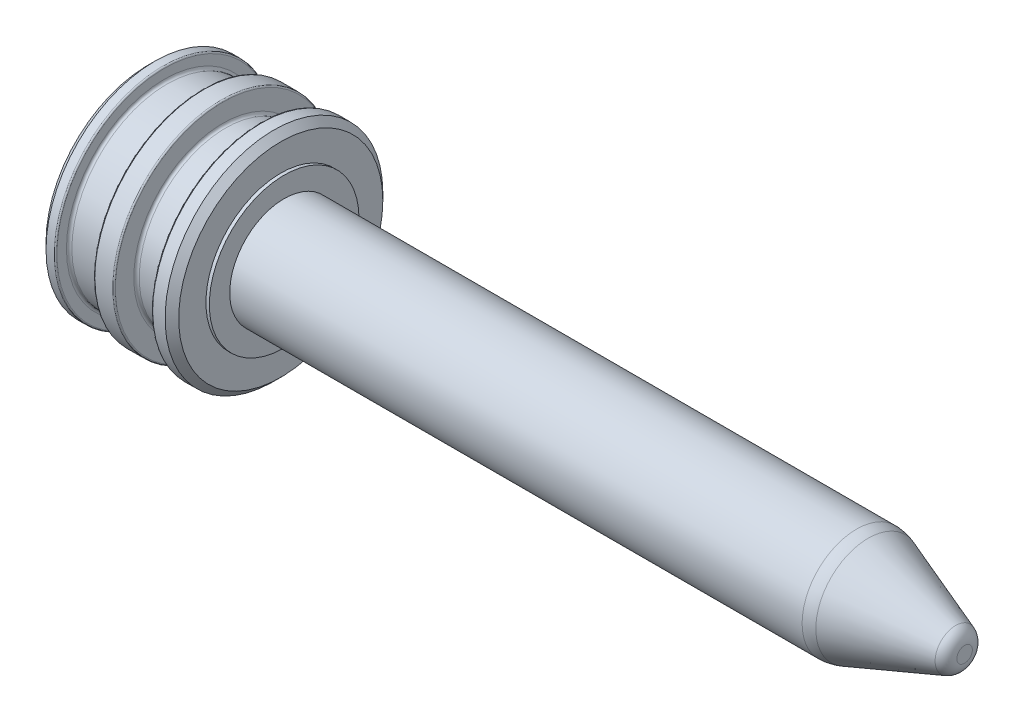
ISO-10303-21;
HEADER;
FILE_DESCRIPTION(('STEP AP214'),'2;1');
FILE_NAME('part.step','',(''),(''),'','','');
FILE_SCHEMA(('AUTOMOTIVE_DESIGN { 1 0 10303 214 1 1 1 1 }'));
ENDSEC;
DATA;
#1=APPLICATION_CONTEXT('core data for automotive mechanical design processes');
#2=APPLICATION_PROTOCOL_DEFINITION('international standard','automotive_design',2000,#1);
#3=PRODUCT_CONTEXT('',#1,'mechanical');
#4=PRODUCT('Part','Part','',(#3));
#5=PRODUCT_RELATED_PRODUCT_CATEGORY('part','',(#4));
#6=PRODUCT_DEFINITION_FORMATION('','',#4);
#7=PRODUCT_DEFINITION_CONTEXT('part definition',#1,'design');
#8=PRODUCT_DEFINITION('design','',#6,#7);
#9=PRODUCT_DEFINITION_SHAPE('','',#8);
#10=(LENGTH_UNIT() NAMED_UNIT(*) SI_UNIT(.MILLI.,.METRE.));
#11=(NAMED_UNIT(*) PLANE_ANGLE_UNIT() SI_UNIT($,.RADIAN.));
#12=(NAMED_UNIT(*) SI_UNIT($,.STERADIAN.) SOLID_ANGLE_UNIT());
#13=UNCERTAINTY_MEASURE_WITH_UNIT(LENGTH_MEASURE(1.E-05),#10,'distance_accuracy_value','');
#14=(GEOMETRIC_REPRESENTATION_CONTEXT(3) GLOBAL_UNCERTAINTY_ASSIGNED_CONTEXT((#13)) GLOBAL_UNIT_ASSIGNED_CONTEXT((#10,
#11,#12)) REPRESENTATION_CONTEXT('',''));
#15=CARTESIAN_POINT('',(0.,0.,0.));
#16=DIRECTION('',(0.,0.,1.));
#17=DIRECTION('',(1.,0.,0.));
#18=AXIS2_PLACEMENT_3D('',#15,#16,#17);
#19=CARTESIAN_POINT('',(0.,0.,0.));
#20=DIRECTION('',(1.,0.,0.));
#21=DIRECTION('',(0.,0.,-1.));
#22=AXIS2_PLACEMENT_3D('',#19,#20,#21);
#23=CYLINDRICAL_SURFACE('',#22,8.);
#24=CARTESIAN_POINT('',(84.1183650964577,0.,0.));
#25=DIRECTION('',(-1.,0.,0.));
#26=DIRECTION('',(0.,0.,1.));
#27=AXIS2_PLACEMENT_3D('',#24,#25,#26);
#28=CIRCLE('',#27,8.);
#29=CARTESIAN_POINT('',(84.1183650964577,0.,8.));
#30=VERTEX_POINT('',#29);
#31=EDGE_CURVE('E118',#30,#30,#28,.T.);
#32=ORIENTED_EDGE('',*,*,#31,.T.);
#33=EDGE_LOOP('',(#32));
#34=FACE_BOUND('',#33,.T.);
#35=CARTESIAN_POINT('',(0.,0.,0.));
#36=DIRECTION('',(1.,0.,0.));
#37=DIRECTION('',(0.,0.,-1.));
#38=AXIS2_PLACEMENT_3D('',#35,#36,#37);
#39=CIRCLE('',#38,8.);
#40=CARTESIAN_POINT('',(0.,0.,-8.));
#41=VERTEX_POINT('',#40);
#42=EDGE_CURVE('E635',#41,#41,#39,.T.);
#43=ORIENTED_EDGE('',*,*,#42,.T.);
#44=EDGE_LOOP('',(#43));
#45=FACE_BOUND('',#44,.T.);
#46=ADVANCED_FACE('F39',(#34,#45),#23,.T.);
#47=CARTESIAN_POINT('',(100.,0.,0.));
#48=DIRECTION('',(-1.,0.,0.));
#49=DIRECTION('',(0.,0.,1.));
#50=AXIS2_PLACEMENT_3D('',#47,#48,#49);
#51=CONICAL_SURFACE('',#50,2.54044648600695,0.349065850398867);
#52=CARTESIAN_POINT('',(98.6840402866513,0.,0.));
#53=DIRECTION('',(1.,0.,0.));
#54=DIRECTION('',(0.,0.,-1.));
#55=AXIS2_PLACEMENT_3D('',#52,#53,#54);
#56=CIRCLE('',#55,3.01941665115935);
#57=CARTESIAN_POINT('',(98.6840402866513,0.,-3.01941665115935));
#58=VERTEX_POINT('',#57);
#59=EDGE_CURVE('E124',#58,#58,#56,.F.);
#60=ORIENTED_EDGE('',*,*,#59,.T.);
#61=EDGE_LOOP('',(#60));
#62=FACE_BOUND('',#61,.T.);
#63=CARTESIAN_POINT('',(85.828465813086,0.,0.));
#64=DIRECTION('',(1.,0.,0.));
#65=DIRECTION('',(0.,0.,-1.));
#66=AXIS2_PLACEMENT_3D('',#63,#64,#65);
#67=CIRCLE('',#66,7.69846310392954);
#68=CARTESIAN_POINT('',(85.828465813086,0.,-7.69846310392954));
#69=VERTEX_POINT('',#68);
#70=EDGE_CURVE('E115',#69,#69,#67,.T.);
#71=ORIENTED_EDGE('',*,*,#70,.T.);
#72=EDGE_LOOP('',(#71));
#73=FACE_BOUND('',#72,.T.);
#74=ADVANCED_FACE('F196',(#62,#73),#51,.T.);
#75=CARTESIAN_POINT('',(100.,2.54044648600695,0.));
#76=DIRECTION('',(1.,0.,0.));
#77=DIRECTION('',(0.,0.,-1.));
#78=AXIS2_PLACEMENT_3D('',#75,#76,#77);
#79=PLANE('',#78);
#80=CARTESIAN_POINT('',(100.,0.,0.));
#81=DIRECTION('',(1.,0.,0.));
#82=DIRECTION('',(0.,0.,-1.));
#83=AXIS2_PLACEMENT_3D('',#80,#81,#82);
#84=CIRCLE('',#83,1.14003140958753);
#85=CARTESIAN_POINT('',(100.,0.,-1.14003140958753));
#86=VERTEX_POINT('',#85);
#87=EDGE_CURVE('E121',#86,#86,#84,.T.);
#88=ORIENTED_EDGE('',*,*,#87,.T.);
#89=EDGE_LOOP('',(#88));
#90=FACE_BOUND('',#89,.T.);
#91=ADVANCED_FACE('F202',(#90),#79,.T.);
#92=CARTESIAN_POINT('',(82.,0.,0.));
#93=DIRECTION('',(-1.,0.,0.));
#94=DIRECTION('',(0.,0.,1.));
#95=AXIS2_PLACEMENT_3D('',#92,#93,#94);
#96=CONICAL_SURFACE('',#95,5.,1.02974425867666);
#97=CARTESIAN_POINT('',(85.0043030951378,0.,0.));
#98=VERTEX_POINT('',#97);
#99=VERTEX_LOOP('',#98);
#100=FACE_BOUND('',#99,.T.);
#101=CARTESIAN_POINT('',(82.,0.,0.));
#102=DIRECTION('',(1.,0.,0.));
#103=DIRECTION('',(0.,0.,-1.));
#104=AXIS2_PLACEMENT_3D('',#101,#102,#103);
#105=CIRCLE('',#104,5.);
#106=CARTESIAN_POINT('',(82.,0.,-5.));
#107=VERTEX_POINT('',#106);
#108=EDGE_CURVE('E105',#107,#107,#105,.T.);
#109=ORIENTED_EDGE('',*,*,#108,.F.);
#110=EDGE_LOOP('',(#109));
#111=FACE_BOUND('',#110,.T.);
#112=ADVANCED_FACE('F297',(#100,#111),#96,.F.);
#113=CARTESIAN_POINT('',(0.,0.,0.));
#114=DIRECTION('',(1.,0.,0.));
#115=DIRECTION('',(0.,0.,-1.));
#116=AXIS2_PLACEMENT_3D('',#113,#114,#115);
#117=CYLINDRICAL_SURFACE('',#116,5.);
#118=ORIENTED_EDGE('',*,*,#108,.T.);
#119=EDGE_LOOP('',(#118));
#120=FACE_BOUND('',#119,.T.);
#121=CARTESIAN_POINT('',(-23.,0.,0.));
#122=DIRECTION('',(1.,0.,0.));
#123=DIRECTION('',(0.,0.,-1.));
#124=AXIS2_PLACEMENT_3D('',#121,#122,#123);
#125=CIRCLE('',#124,5.);
#126=CARTESIAN_POINT('',(-23.,0.,-5.));
#127=VERTEX_POINT('',#126);
#128=EDGE_CURVE('E101',#127,#127,#125,.T.);
#129=ORIENTED_EDGE('',*,*,#128,.F.);
#130=EDGE_LOOP('',(#129));
#131=FACE_BOUND('',#130,.T.);
#132=ADVANCED_FACE('F294',(#120,#131),#117,.F.);
#133=CARTESIAN_POINT('',(-23.,7.,0.));
#134=DIRECTION('',(-1.,0.,0.));
#135=DIRECTION('',(0.,0.,1.));
#136=AXIS2_PLACEMENT_3D('',#133,#134,#135);
#137=PLANE('',#136);
#138=CARTESIAN_POINT('',(-23.,9.5,0.));
#139=DIRECTION('',(-1.,0.,0.));
#140=DIRECTION('',(0.,0.,1.));
#141=AXIS2_PLACEMENT_3D('',#138,#139,#140);
#142=CIRCLE('',#141,3.);
#143=CARTESIAN_POINT('',(-23.,6.85526315789473,-1.41610982484095));
#144=VERTEX_POINT('',#143);
#145=CARTESIAN_POINT('',(-23.,6.85526315789473,1.41610982484095));
#146=VERTEX_POINT('',#145);
#147=EDGE_CURVE('E82',#144,#146,#142,.T.);
#148=ORIENTED_EDGE('',*,*,#147,.F.);
#149=CARTESIAN_POINT('',(-23.,0.,0.));
#150=DIRECTION('',(1.,0.,0.));
#151=DIRECTION('',(0.,0.,-1.));
#152=AXIS2_PLACEMENT_3D('',#149,#150,#151);
#153=CIRCLE('',#152,7.);
#154=EDGE_CURVE('E97',#146,#144,#153,.T.);
#155=ORIENTED_EDGE('',*,*,#154,.F.);
#156=EDGE_LOOP('',(#148,#155));
#157=FACE_BOUND('',#156,.T.);
#158=ORIENTED_EDGE('',*,*,#128,.T.);
#159=EDGE_LOOP('',(#158));
#160=FACE_BOUND('',#159,.T.);
#161=ADVANCED_FACE('F95',(#157,#160),#137,.T.);
#162=CARTESIAN_POINT('',(0.,0.,0.));
#163=DIRECTION('',(1.,0.,0.));
#164=DIRECTION('',(0.,0.,-1.));
#165=AXIS2_PLACEMENT_3D('',#162,#163,#164);
#166=CYLINDRICAL_SURFACE('',#165,7.);
#167=DIRECTION('',(-1.,0.,0.));
#168=VECTOR('',#167,1.);
#169=CARTESIAN_POINT('',(-16.5,6.85526315789473,1.41610982484095));
#170=LINE('',#169,#168);
#171=CARTESIAN_POINT('',(-21.2,6.85526315789473,1.41610982484095));
#172=VERTEX_POINT('',#171);
#173=EDGE_CURVE('E90',#146,#172,#170,.F.);
#174=ORIENTED_EDGE('',*,*,#173,.F.);
#175=ORIENTED_EDGE('',*,*,#154,.T.);
#176=DIRECTION('',(-1.,0.,0.));
#177=VECTOR('',#176,1.);
#178=CARTESIAN_POINT('',(-16.5,6.85526315789473,-1.41610982484095));
#179=LINE('',#178,#177);
#180=CARTESIAN_POINT('',(-21.2,6.85526315789473,-1.41610982484095));
#181=VERTEX_POINT('',#180);
#182=EDGE_CURVE('E78',#181,#144,#179,.T.);
#183=ORIENTED_EDGE('',*,*,#182,.F.);
#184=CARTESIAN_POINT('',(-21.2,0.,0.));
#185=DIRECTION('',(1.,0.,0.));
#186=DIRECTION('',(0.,0.,-1.));
#187=AXIS2_PLACEMENT_3D('',#184,#185,#186);
#188=CIRCLE('',#187,7.);
#189=EDGE_CURVE('E102',#172,#181,#188,.T.);
#190=ORIENTED_EDGE('',*,*,#189,.F.);
#191=EDGE_LOOP('',(#174,#175,#183,#190));
#192=FACE_BOUND('',#191,.T.);
#193=ADVANCED_FACE('F100',(#192),#166,.T.);
#194=CARTESIAN_POINT('',(-21.2,7.,0.));
#195=DIRECTION('',(1.,0.,0.));
#196=DIRECTION('',(0.,0.,-1.));
#197=AXIS2_PLACEMENT_3D('',#194,#195,#196);
#198=PLANE('',#197);
#199=CARTESIAN_POINT('',(-21.2,9.5,0.));
#200=DIRECTION('',(1.,0.,0.));
#201=DIRECTION('',(0.,0.,-1.));
#202=AXIS2_PLACEMENT_3D('',#199,#200,#201);
#203=CIRCLE('',#202,3.);
#204=CARTESIAN_POINT('',(-21.2,6.56894736842105,0.639476716475363));
#205=VERTEX_POINT('',#204);
#206=EDGE_CURVE('E91',#172,#205,#203,.T.);
#207=ORIENTED_EDGE('',*,*,#206,.F.);
#208=ORIENTED_EDGE('',*,*,#189,.T.);
#209=CARTESIAN_POINT('',(-21.2,6.56894736842105,-0.639476716475362));
#210=VERTEX_POINT('',#209);
#211=EDGE_CURVE('E85',#210,#181,#203,.T.);
#212=ORIENTED_EDGE('',*,*,#211,.F.);
#213=CARTESIAN_POINT('',(-21.2,0.,0.));
#214=DIRECTION('',(1.,0.,0.));
#215=DIRECTION('',(0.,0.,-1.));
#216=AXIS2_PLACEMENT_3D('',#213,#214,#215);
#217=CIRCLE('',#216,6.6);
#218=EDGE_CURVE('E107',#205,#210,#217,.T.);
#219=ORIENTED_EDGE('',*,*,#218,.F.);
#220=EDGE_LOOP('',(#207,#208,#212,#219));
#221=FACE_BOUND('',#220,.T.);
#222=ADVANCED_FACE('F285',(#221),#198,.T.);
#223=CARTESIAN_POINT('',(0.,0.,0.));
#224=DIRECTION('',(1.,0.,0.));
#225=DIRECTION('',(0.,0.,-1.));
#226=AXIS2_PLACEMENT_3D('',#223,#224,#225);
#227=CYLINDRICAL_SURFACE('',#226,6.6);
#228=DIRECTION('',(-1.,0.,0.));
#229=VECTOR('',#228,1.);
#230=CARTESIAN_POINT('',(-16.5,6.56894736842105,0.639476716475363));
#231=LINE('',#230,#229);
#232=CARTESIAN_POINT('',(-20.,6.56894736842105,0.639476716475362));
#233=VERTEX_POINT('',#232);
#234=EDGE_CURVE('E54',#205,#233,#231,.F.);
#235=ORIENTED_EDGE('',*,*,#234,.F.);
#236=ORIENTED_EDGE('',*,*,#218,.T.);
#237=DIRECTION('',(-1.,0.,0.));
#238=VECTOR('',#237,1.);
#239=CARTESIAN_POINT('',(-16.5,6.56894736842105,-0.639476716475363));
#240=LINE('',#239,#238);
#241=CARTESIAN_POINT('',(-20.,6.56894736842105,-0.639476716475362));
#242=VERTEX_POINT('',#241);
#243=EDGE_CURVE('E642',#242,#210,#240,.T.);
#244=ORIENTED_EDGE('',*,*,#243,.F.);
#245=CARTESIAN_POINT('',(-20.,0.,0.));
#246=DIRECTION('',(1.,0.,0.));
#247=DIRECTION('',(0.,0.,-1.));
#248=AXIS2_PLACEMENT_3D('',#245,#246,#247);
#249=CIRCLE('',#248,6.6);
#250=EDGE_CURVE('E629',#233,#242,#249,.T.);
#251=ORIENTED_EDGE('',*,*,#250,.F.);
#252=EDGE_LOOP('',(#235,#236,#244,#251));
#253=FACE_BOUND('',#252,.T.);
#254=ADVANCED_FACE('F281',(#253),#227,.T.);
#255=CARTESIAN_POINT('',(-20.,16.,0.));
#256=DIRECTION('',(-1.,0.,0.));
#257=DIRECTION('',(0.,0.,1.));
#258=AXIS2_PLACEMENT_3D('',#255,#256,#257);
#259=PLANE('',#258);
#260=CARTESIAN_POINT('',(-20.,0.,0.));
#261=DIRECTION('',(-1.,0.,0.));
#262=DIRECTION('',(0.,0.,1.));
#263=AXIS2_PLACEMENT_3D('',#260,#261,#262);
#264=CIRCLE('',#263,15.);
#265=CARTESIAN_POINT('',(-20.,0.,15.));
#266=VERTEX_POINT('',#265);
#267=EDGE_CURVE('E136',#266,#266,#264,.T.);
#268=ORIENTED_EDGE('',*,*,#267,.T.);
#269=EDGE_LOOP('',(#268));
#270=FACE_BOUND('',#269,.T.);
#271=CARTESIAN_POINT('',(-20.,9.5,0.));
#272=DIRECTION('',(-1.,0.,0.));
#273=DIRECTION('',(0.,0.,1.));
#274=AXIS2_PLACEMENT_3D('',#271,#272,#273);
#275=CIRCLE('',#274,3.);
#276=EDGE_CURVE('E113',#233,#242,#275,.T.);
#277=ORIENTED_EDGE('',*,*,#276,.F.);
#278=ORIENTED_EDGE('',*,*,#250,.T.);
#279=EDGE_LOOP('',(#277,#278));
#280=FACE_BOUND('',#279,.T.);
#281=ADVANCED_FACE('F277',(#270,#280),#259,.T.);
#282=CARTESIAN_POINT('',(0.,0.,0.));
#283=DIRECTION('',(1.,0.,0.));
#284=DIRECTION('',(0.,0.,-1.));
#285=AXIS2_PLACEMENT_3D('',#282,#283,#284);
#286=CYLINDRICAL_SURFACE('',#285,16.);
#287=CARTESIAN_POINT('',(-17.8,0.,0.));
#288=DIRECTION('',(1.,0.,0.));
#289=DIRECTION('',(0.,0.,-1.));
#290=AXIS2_PLACEMENT_3D('',#287,#288,#289);
#291=CIRCLE('',#290,16.);
#292=CARTESIAN_POINT('',(-17.8,0.,-16.));
#293=VERTEX_POINT('',#292);
#294=EDGE_CURVE('E175',#293,#293,#291,.F.);
#295=ORIENTED_EDGE('',*,*,#294,.T.);
#296=EDGE_LOOP('',(#295));
#297=FACE_BOUND('',#296,.T.);
#298=CARTESIAN_POINT('',(-19.,0.,0.));
#299=DIRECTION('',(-1.,0.,0.));
#300=DIRECTION('',(0.,0.,1.));
#301=AXIS2_PLACEMENT_3D('',#298,#299,#300);
#302=CIRCLE('',#301,16.);
#303=CARTESIAN_POINT('',(-19.,0.,16.));
#304=VERTEX_POINT('',#303);
#305=EDGE_CURVE('E133',#304,#304,#302,.F.);
#306=ORIENTED_EDGE('',*,*,#305,.T.);
#307=EDGE_LOOP('',(#306));
#308=FACE_BOUND('',#307,.T.);
#309=ADVANCED_FACE('F257',(#297,#308),#286,.T.);
#310=CARTESIAN_POINT('',(-17.6,14.,0.));
#311=DIRECTION('',(1.,0.,0.));
#312=DIRECTION('',(0.,0.,-1.));
#313=AXIS2_PLACEMENT_3D('',#310,#311,#312);
#314=PLANE('',#313);
#315=CARTESIAN_POINT('',(-17.6,0.,0.));
#316=DIRECTION('',(1.,0.,0.));
#317=DIRECTION('',(0.,0.,-1.));
#318=AXIS2_PLACEMENT_3D('',#315,#316,#317);
#319=CIRCLE('',#318,15.8);
#320=CARTESIAN_POINT('',(-17.6,0.,-15.8));
#321=VERTEX_POINT('',#320);
#322=EDGE_CURVE('E172',#321,#321,#319,.T.);
#323=ORIENTED_EDGE('',*,*,#322,.T.);
#324=EDGE_LOOP('',(#323));
#325=FACE_BOUND('',#324,.T.);
#326=CARTESIAN_POINT('',(-17.6,0.,0.));
#327=DIRECTION('',(1.,0.,0.));
#328=DIRECTION('',(0.,0.,-1.));
#329=AXIS2_PLACEMENT_3D('',#326,#327,#328);
#330=CIRCLE('',#329,14.4);
#331=CARTESIAN_POINT('',(-17.6,0.,-14.4));
#332=VERTEX_POINT('',#331);
#333=EDGE_CURVE('E148',#332,#332,#330,.F.);
#334=ORIENTED_EDGE('',*,*,#333,.T.);
#335=EDGE_LOOP('',(#334));
#336=FACE_BOUND('',#335,.T.);
#337=ADVANCED_FACE('F253',(#325,#336),#314,.T.);
#338=CARTESIAN_POINT('',(0.,0.,0.));
#339=DIRECTION('',(1.,0.,0.));
#340=DIRECTION('',(0.,0.,-1.));
#341=AXIS2_PLACEMENT_3D('',#338,#339,#340);
#342=CYLINDRICAL_SURFACE('',#341,14.);
#343=CARTESIAN_POINT('',(-12.4,0.,0.));
#344=DIRECTION('',(-1.,0.,0.));
#345=DIRECTION('',(0.,0.,1.));
#346=AXIS2_PLACEMENT_3D('',#343,#344,#345);
#347=CIRCLE('',#346,14.);
#348=CARTESIAN_POINT('',(-12.4,0.,14.));
#349=VERTEX_POINT('',#348);
#350=EDGE_CURVE('E145',#349,#349,#347,.T.);
#351=ORIENTED_EDGE('',*,*,#350,.T.);
#352=EDGE_LOOP('',(#351));
#353=FACE_BOUND('',#352,.T.);
#354=CARTESIAN_POINT('',(-17.2,0.,0.));
#355=DIRECTION('',(1.,0.,0.));
#356=DIRECTION('',(0.,0.,-1.));
#357=AXIS2_PLACEMENT_3D('',#354,#355,#356);
#358=CIRCLE('',#357,14.);
#359=CARTESIAN_POINT('',(-17.2,0.,-14.));
#360=VERTEX_POINT('',#359);
#361=EDGE_CURVE('E142',#360,#360,#358,.T.);
#362=ORIENTED_EDGE('',*,*,#361,.T.);
#363=EDGE_LOOP('',(#362));
#364=FACE_BOUND('',#363,.T.);
#365=ADVANCED_FACE('F256',(#353,#364),#342,.T.);
#366=CARTESIAN_POINT('',(-12.,16.,0.));
#367=DIRECTION('',(-1.,0.,0.));
#368=DIRECTION('',(0.,0.,1.));
#369=AXIS2_PLACEMENT_3D('',#366,#367,#368);
#370=PLANE('',#369);
#371=CARTESIAN_POINT('',(-12.,0.,0.));
#372=DIRECTION('',(-1.,0.,0.));
#373=DIRECTION('',(0.,0.,1.));
#374=AXIS2_PLACEMENT_3D('',#371,#372,#373);
#375=CIRCLE('',#374,15.8);
#376=CARTESIAN_POINT('',(-12.,0.,15.8));
#377=VERTEX_POINT('',#376);
#378=EDGE_CURVE('E169',#377,#377,#375,.T.);
#379=ORIENTED_EDGE('',*,*,#378,.T.);
#380=EDGE_LOOP('',(#379));
#381=FACE_BOUND('',#380,.T.);
#382=CARTESIAN_POINT('',(-12.,0.,0.));
#383=DIRECTION('',(-1.,0.,0.));
#384=DIRECTION('',(0.,0.,1.));
#385=AXIS2_PLACEMENT_3D('',#382,#383,#384);
#386=CIRCLE('',#385,14.4);
#387=CARTESIAN_POINT('',(-12.,0.,14.4));
#388=VERTEX_POINT('',#387);
#389=EDGE_CURVE('E139',#388,#388,#386,.F.);
#390=ORIENTED_EDGE('',*,*,#389,.T.);
#391=EDGE_LOOP('',(#390));
#392=FACE_BOUND('',#391,.T.);
#393=ADVANCED_FACE('F264',(#381,#392),#370,.T.);
#394=CARTESIAN_POINT('',(0.,0.,0.));
#395=DIRECTION('',(1.,0.,0.));
#396=DIRECTION('',(0.,0.,-1.));
#397=AXIS2_PLACEMENT_3D('',#394,#395,#396);
#398=CYLINDRICAL_SURFACE('',#397,16.);
#399=CARTESIAN_POINT('',(-11.8,0.,0.));
#400=DIRECTION('',(-1.,0.,0.));
#401=DIRECTION('',(0.,0.,1.));
#402=AXIS2_PLACEMENT_3D('',#399,#400,#401);
#403=CIRCLE('',#402,16.);
#404=CARTESIAN_POINT('',(-11.8,0.,16.));
#405=VERTEX_POINT('',#404);
#406=EDGE_CURVE('E166',#405,#405,#403,.F.);
#407=ORIENTED_EDGE('',*,*,#406,.T.);
#408=EDGE_LOOP('',(#407));
#409=FACE_BOUND('',#408,.T.);
#410=CARTESIAN_POINT('',(-9.2,0.,0.));
#411=DIRECTION('',(1.,0.,0.));
#412=DIRECTION('',(0.,0.,-1.));
#413=AXIS2_PLACEMENT_3D('',#410,#411,#412);
#414=CIRCLE('',#413,16.);
#415=CARTESIAN_POINT('',(-9.2,0.,-16.));
#416=VERTEX_POINT('',#415);
#417=EDGE_CURVE('E163',#416,#416,#414,.F.);
#418=ORIENTED_EDGE('',*,*,#417,.T.);
#419=EDGE_LOOP('',(#418));
#420=FACE_BOUND('',#419,.T.);
#421=ADVANCED_FACE('F270',(#409,#420),#398,.T.);
#422=CARTESIAN_POINT('',(-9.,12.7,0.));
#423=DIRECTION('',(1.,0.,0.));
#424=DIRECTION('',(0.,0.,-1.));
#425=AXIS2_PLACEMENT_3D('',#422,#423,#424);
#426=PLANE('',#425);
#427=CARTESIAN_POINT('',(-9.,0.,0.));
#428=DIRECTION('',(1.,0.,0.));
#429=DIRECTION('',(0.,0.,-1.));
#430=AXIS2_PLACEMENT_3D('',#427,#428,#429);
#431=CIRCLE('',#430,15.8);
#432=CARTESIAN_POINT('',(-9.,0.,-15.8));
#433=VERTEX_POINT('',#432);
#434=EDGE_CURVE('E178',#433,#433,#431,.T.);
#435=ORIENTED_EDGE('',*,*,#434,.T.);
#436=EDGE_LOOP('',(#435));
#437=FACE_BOUND('',#436,.T.);
#438=CARTESIAN_POINT('',(-9.,0.,0.));
#439=DIRECTION('',(1.,0.,0.));
#440=DIRECTION('',(0.,0.,-1.));
#441=AXIS2_PLACEMENT_3D('',#438,#439,#440);
#442=CIRCLE('',#441,13.1);
#443=CARTESIAN_POINT('',(-9.,0.,-13.1));
#444=VERTEX_POINT('',#443);
#445=EDGE_CURVE('E160',#444,#444,#442,.F.);
#446=ORIENTED_EDGE('',*,*,#445,.T.);
#447=EDGE_LOOP('',(#446));
#448=FACE_BOUND('',#447,.T.);
#449=ADVANCED_FACE('F368',(#437,#448),#426,.T.);
#450=CARTESIAN_POINT('',(0.,0.,0.));
#451=DIRECTION('',(1.,0.,0.));
#452=DIRECTION('',(0.,0.,-1.));
#453=AXIS2_PLACEMENT_3D('',#450,#451,#452);
#454=CYLINDRICAL_SURFACE('',#453,12.7);
#455=CARTESIAN_POINT('',(-3.9,0.,0.));
#456=DIRECTION('',(-1.,0.,0.));
#457=DIRECTION('',(0.,0.,1.));
#458=AXIS2_PLACEMENT_3D('',#455,#456,#457);
#459=CIRCLE('',#458,12.7);
#460=CARTESIAN_POINT('',(-3.9,0.,12.7));
#461=VERTEX_POINT('',#460);
#462=EDGE_CURVE('E157',#461,#461,#459,.T.);
#463=ORIENTED_EDGE('',*,*,#462,.T.);
#464=EDGE_LOOP('',(#463));
#465=FACE_BOUND('',#464,.T.);
#466=CARTESIAN_POINT('',(-8.6,0.,0.));
#467=DIRECTION('',(1.,0.,0.));
#468=DIRECTION('',(0.,0.,-1.));
#469=AXIS2_PLACEMENT_3D('',#466,#467,#468);
#470=CIRCLE('',#469,12.7);
#471=CARTESIAN_POINT('',(-8.6,0.,-12.7));
#472=VERTEX_POINT('',#471);
#473=EDGE_CURVE('E154',#472,#472,#470,.T.);
#474=ORIENTED_EDGE('',*,*,#473,.T.);
#475=EDGE_LOOP('',(#474));
#476=FACE_BOUND('',#475,.T.);
#477=ADVANCED_FACE('F378',(#465,#476),#454,.T.);
#478=CARTESIAN_POINT('',(-3.5,16.,0.));
#479=DIRECTION('',(-1.,0.,0.));
#480=DIRECTION('',(0.,0.,1.));
#481=AXIS2_PLACEMENT_3D('',#478,#479,#480);
#482=PLANE('',#481);
#483=CARTESIAN_POINT('',(-3.5,0.,0.));
#484=DIRECTION('',(-1.,0.,0.));
#485=DIRECTION('',(0.,0.,1.));
#486=AXIS2_PLACEMENT_3D('',#483,#484,#485);
#487=CIRCLE('',#486,15.8);
#488=CARTESIAN_POINT('',(-3.5,0.,15.8));
#489=VERTEX_POINT('',#488);
#490=EDGE_CURVE('E11',#489,#489,#487,.T.);
#491=ORIENTED_EDGE('',*,*,#490,.T.);
#492=EDGE_LOOP('',(#491));
#493=FACE_BOUND('',#492,.T.);
#494=CARTESIAN_POINT('',(-3.5,0.,0.));
#495=DIRECTION('',(-1.,0.,0.));
#496=DIRECTION('',(0.,0.,1.));
#497=AXIS2_PLACEMENT_3D('',#494,#495,#496);
#498=CIRCLE('',#497,13.1);
#499=CARTESIAN_POINT('',(-3.5,0.,13.1));
#500=VERTEX_POINT('',#499);
#501=EDGE_CURVE('E151',#500,#500,#498,.F.);
#502=ORIENTED_EDGE('',*,*,#501,.T.);
#503=EDGE_LOOP('',(#502));
#504=FACE_BOUND('',#503,.T.);
#505=ADVANCED_FACE('F387',(#493,#504),#482,.T.);
#506=CARTESIAN_POINT('',(0.,0.,0.));
#507=DIRECTION('',(1.,0.,0.));
#508=DIRECTION('',(0.,0.,-1.));
#509=AXIS2_PLACEMENT_3D('',#506,#507,#508);
#510=CYLINDRICAL_SURFACE('',#509,16.);
#511=CARTESIAN_POINT('',(-3.3,0.,0.));
#512=DIRECTION('',(-1.,0.,0.));
#513=DIRECTION('',(0.,0.,1.));
#514=AXIS2_PLACEMENT_3D('',#511,#512,#513);
#515=CIRCLE('',#514,16.);
#516=CARTESIAN_POINT('',(-3.3,0.,16.));
#517=VERTEX_POINT('',#516);
#518=EDGE_CURVE('E47',#517,#517,#515,.F.);
#519=ORIENTED_EDGE('',*,*,#518,.T.);
#520=EDGE_LOOP('',(#519));
#521=FACE_BOUND('',#520,.T.);
#522=CARTESIAN_POINT('',(-1.5,0.,0.));
#523=DIRECTION('',(1.,0.,0.));
#524=DIRECTION('',(0.,0.,-1.));
#525=AXIS2_PLACEMENT_3D('',#522,#523,#524);
#526=CIRCLE('',#525,16.);
#527=CARTESIAN_POINT('',(-1.5,0.,-16.));
#528=VERTEX_POINT('',#527);
#529=EDGE_CURVE('E130',#528,#528,#526,.F.);
#530=ORIENTED_EDGE('',*,*,#529,.T.);
#531=EDGE_LOOP('',(#530));
#532=FACE_BOUND('',#531,.T.);
#533=ADVANCED_FACE('F183',(#521,#532),#510,.T.);
#534=CARTESIAN_POINT('',(-0.5,11.,0.));
#535=DIRECTION('',(1.,0.,0.));
#536=DIRECTION('',(0.,0.,-1.));
#537=AXIS2_PLACEMENT_3D('',#534,#535,#536);
#538=PLANE('',#537);
#539=CARTESIAN_POINT('',(-0.5,0.,0.));
#540=DIRECTION('',(1.,0.,0.));
#541=DIRECTION('',(0.,0.,-1.));
#542=AXIS2_PLACEMENT_3D('',#539,#540,#541);
#543=CIRCLE('',#542,15.);
#544=CARTESIAN_POINT('',(-0.5,0.,-15.));
#545=VERTEX_POINT('',#544);
#546=EDGE_CURVE('E127',#545,#545,#543,.T.);
#547=ORIENTED_EDGE('',*,*,#546,.T.);
#548=EDGE_LOOP('',(#547));
#549=FACE_BOUND('',#548,.T.);
#550=CARTESIAN_POINT('',(-0.5,0.,0.));
#551=DIRECTION('',(1.,0.,0.));
#552=DIRECTION('',(0.,0.,-1.));
#553=AXIS2_PLACEMENT_3D('',#550,#551,#552);
#554=CIRCLE('',#553,11.);
#555=CARTESIAN_POINT('',(-0.5,0.,-11.));
#556=VERTEX_POINT('',#555);
#557=EDGE_CURVE('E628',#556,#556,#554,.T.);
#558=ORIENTED_EDGE('',*,*,#557,.F.);
#559=EDGE_LOOP('',(#558));
#560=FACE_BOUND('',#559,.T.);
#561=ADVANCED_FACE('F402',(#549,#560),#538,.T.);
#562=CARTESIAN_POINT('',(0.,0.,0.));
#563=DIRECTION('',(1.,0.,0.));
#564=DIRECTION('',(0.,0.,-1.));
#565=AXIS2_PLACEMENT_3D('',#562,#563,#564);
#566=CYLINDRICAL_SURFACE('',#565,11.);
#567=ORIENTED_EDGE('',*,*,#557,.T.);
#568=EDGE_LOOP('',(#567));
#569=FACE_BOUND('',#568,.T.);
#570=CARTESIAN_POINT('',(0.,0.,0.));
#571=DIRECTION('',(1.,0.,0.));
#572=DIRECTION('',(0.,0.,-1.));
#573=AXIS2_PLACEMENT_3D('',#570,#571,#572);
#574=CIRCLE('',#573,11.);
#575=CARTESIAN_POINT('',(0.,0.,-11.));
#576=VERTEX_POINT('',#575);
#577=EDGE_CURVE('E630',#576,#576,#574,.T.);
#578=ORIENTED_EDGE('',*,*,#577,.F.);
#579=EDGE_LOOP('',(#578));
#580=FACE_BOUND('',#579,.T.);
#581=ADVANCED_FACE('F505',(#569,#580),#566,.T.);
#582=CARTESIAN_POINT('',(0.,11.,0.));
#583=DIRECTION('',(1.,0.,0.));
#584=DIRECTION('',(0.,0.,-1.));
#585=AXIS2_PLACEMENT_3D('',#582,#583,#584);
#586=PLANE('',#585);
#587=ORIENTED_EDGE('',*,*,#577,.T.);
#588=EDGE_LOOP('',(#587));
#589=FACE_BOUND('',#588,.T.);
#590=ORIENTED_EDGE('',*,*,#42,.F.);
#591=EDGE_LOOP('',(#590));
#592=FACE_BOUND('',#591,.T.);
#593=ADVANCED_FACE('F497',(#589,#592),#586,.T.);
#594=CARTESIAN_POINT('',(-10.,9.5,0.));
#595=DIRECTION('',(-1.,0.,0.));
#596=DIRECTION('',(0.,0.,1.));
#597=AXIS2_PLACEMENT_3D('',#594,#595,#596);
#598=CYLINDRICAL_SURFACE('',#597,3.);
#599=ORIENTED_EDGE('',*,*,#173,.T.);
#600=ORIENTED_EDGE('',*,*,#206,.T.);
#601=ORIENTED_EDGE('',*,*,#234,.T.);
#602=ORIENTED_EDGE('',*,*,#276,.T.);
#603=ORIENTED_EDGE('',*,*,#243,.T.);
#604=ORIENTED_EDGE('',*,*,#211,.T.);
#605=ORIENTED_EDGE('',*,*,#182,.T.);
#606=ORIENTED_EDGE('',*,*,#147,.T.);
#607=EDGE_LOOP('',(#599,#600,#601,#602,#603,#604,#605,#606));
#608=FACE_BOUND('',#607,.T.);
#609=CARTESIAN_POINT('',(-10.,9.5,0.));
#610=DIRECTION('',(-1.,0.,0.));
#611=DIRECTION('',(0.,0.,1.));
#612=AXIS2_PLACEMENT_3D('',#609,#610,#611);
#613=CIRCLE('',#612,3.);
#614=CARTESIAN_POINT('',(-10.,9.5,3.));
#615=VERTEX_POINT('',#614);
#616=EDGE_CURVE('E98',#615,#615,#613,.T.);
#617=ORIENTED_EDGE('',*,*,#616,.F.);
#618=EDGE_LOOP('',(#617));
#619=FACE_BOUND('',#618,.T.);
#620=ADVANCED_FACE('F80',(#608,#619),#598,.F.);
#621=CARTESIAN_POINT('',(-10.,9.5,0.));
#622=DIRECTION('',(-1.,0.,0.));
#623=DIRECTION('',(0.,0.,1.));
#624=AXIS2_PLACEMENT_3D('',#621,#622,#623);
#625=PLANE('',#624);
#626=ORIENTED_EDGE('',*,*,#616,.T.);
#627=EDGE_LOOP('',(#626));
#628=FACE_BOUND('',#627,.T.);
#629=ADVANCED_FACE('F212',(#628),#625,.T.);
#630=CARTESIAN_POINT('',(84.1183650964577,0.,0.));
#631=DIRECTION('',(-1.,0.,0.));
#632=DIRECTION('',(0.,0.,1.));
#633=AXIS2_PLACEMENT_3D('',#630,#631,#632);
#634=DEGENERATE_TOROIDAL_SURFACE('',#633,3.,5.,.T.);
#635=ORIENTED_EDGE('',*,*,#31,.F.);
#636=EDGE_LOOP('',(#635));
#637=FACE_BOUND('',#636,.T.);
#638=ORIENTED_EDGE('',*,*,#70,.F.);
#639=EDGE_LOOP('',(#638));
#640=FACE_BOUND('',#639,.T.);
#641=ADVANCED_FACE('F208',(#637,#640),#634,.T.);
#642=CARTESIAN_POINT('',(98.,0.,0.));
#643=DIRECTION('',(1.,0.,0.));
#644=DIRECTION('',(0.,0.,-1.));
#645=AXIS2_PLACEMENT_3D('',#642,#643,#644);
#646=DEGENERATE_TOROIDAL_SURFACE('',#645,1.14003140958753,2.,.T.);
#647=ORIENTED_EDGE('',*,*,#59,.F.);
#648=EDGE_LOOP('',(#647));
#649=FACE_BOUND('',#648,.T.);
#650=ORIENTED_EDGE('',*,*,#87,.F.);
#651=EDGE_LOOP('',(#650));
#652=FACE_BOUND('',#651,.T.);
#653=ADVANCED_FACE('F211',(#649,#652),#646,.T.);
#654=CARTESIAN_POINT('',(-0.5,0.,0.));
#655=DIRECTION('',(-1.,0.,0.));
#656=DIRECTION('',(0.,0.,1.));
#657=AXIS2_PLACEMENT_3D('',#654,#655,#656);
#658=CONICAL_SURFACE('',#657,15.,0.785398163397448);
#659=ORIENTED_EDGE('',*,*,#529,.F.);
#660=EDGE_LOOP('',(#659));
#661=FACE_BOUND('',#660,.T.);
#662=ORIENTED_EDGE('',*,*,#546,.F.);
#663=EDGE_LOOP('',(#662));
#664=FACE_BOUND('',#663,.T.);
#665=ADVANCED_FACE('F216',(#661,#664),#658,.T.);
#666=CARTESIAN_POINT('',(-19.,0.,0.));
#667=DIRECTION('',(1.,0.,0.));
#668=DIRECTION('',(0.,0.,-1.));
#669=AXIS2_PLACEMENT_3D('',#666,#667,#668);
#670=CONICAL_SURFACE('',#669,16.,0.785398163397448);
#671=ORIENTED_EDGE('',*,*,#267,.F.);
#672=EDGE_LOOP('',(#671));
#673=FACE_BOUND('',#672,.T.);
#674=ORIENTED_EDGE('',*,*,#305,.F.);
#675=EDGE_LOOP('',(#674));
#676=FACE_BOUND('',#675,.T.);
#677=ADVANCED_FACE('F220',(#673,#676),#670,.T.);
#678=CARTESIAN_POINT('',(-12.4,0.,0.));
#679=DIRECTION('',(-1.,0.,0.));
#680=DIRECTION('',(0.,0.,1.));
#681=AXIS2_PLACEMENT_3D('',#678,#679,#680);
#682=TOROIDAL_SURFACE('',#681,14.4,0.4);
#683=ORIENTED_EDGE('',*,*,#350,.F.);
#684=EDGE_LOOP('',(#683));
#685=FACE_BOUND('',#684,.T.);
#686=ORIENTED_EDGE('',*,*,#389,.F.);
#687=EDGE_LOOP('',(#686));
#688=FACE_BOUND('',#687,.T.);
#689=ADVANCED_FACE('F224',(#685,#688),#682,.F.);
#690=CARTESIAN_POINT('',(-17.2,0.,0.));
#691=DIRECTION('',(1.,0.,0.));
#692=DIRECTION('',(0.,0.,-1.));
#693=AXIS2_PLACEMENT_3D('',#690,#691,#692);
#694=TOROIDAL_SURFACE('',#693,14.4,0.4);
#695=ORIENTED_EDGE('',*,*,#333,.F.);
#696=EDGE_LOOP('',(#695));
#697=FACE_BOUND('',#696,.T.);
#698=ORIENTED_EDGE('',*,*,#361,.F.);
#699=EDGE_LOOP('',(#698));
#700=FACE_BOUND('',#699,.T.);
#701=ADVANCED_FACE('F228',(#697,#700),#694,.F.);
#702=CARTESIAN_POINT('',(-3.9,0.,0.));
#703=DIRECTION('',(-1.,0.,0.));
#704=DIRECTION('',(0.,0.,1.));
#705=AXIS2_PLACEMENT_3D('',#702,#703,#704);
#706=TOROIDAL_SURFACE('',#705,13.1,0.4);
#707=ORIENTED_EDGE('',*,*,#462,.F.);
#708=EDGE_LOOP('',(#707));
#709=FACE_BOUND('',#708,.T.);
#710=ORIENTED_EDGE('',*,*,#501,.F.);
#711=EDGE_LOOP('',(#710));
#712=FACE_BOUND('',#711,.T.);
#713=ADVANCED_FACE('F232',(#709,#712),#706,.F.);
#714=CARTESIAN_POINT('',(-8.6,0.,0.));
#715=DIRECTION('',(1.,0.,0.));
#716=DIRECTION('',(0.,0.,-1.));
#717=AXIS2_PLACEMENT_3D('',#714,#715,#716);
#718=TOROIDAL_SURFACE('',#717,13.1,0.4);
#719=ORIENTED_EDGE('',*,*,#445,.F.);
#720=EDGE_LOOP('',(#719));
#721=FACE_BOUND('',#720,.T.);
#722=ORIENTED_EDGE('',*,*,#473,.F.);
#723=EDGE_LOOP('',(#722));
#724=FACE_BOUND('',#723,.T.);
#725=ADVANCED_FACE('F236',(#721,#724),#718,.F.);
#726=CARTESIAN_POINT('',(-11.8,0.,0.));
#727=DIRECTION('',(-1.,0.,0.));
#728=DIRECTION('',(0.,0.,1.));
#729=AXIS2_PLACEMENT_3D('',#726,#727,#728);
#730=TOROIDAL_SURFACE('',#729,15.8,0.2);
#731=ORIENTED_EDGE('',*,*,#378,.F.);
#732=EDGE_LOOP('',(#731));
#733=FACE_BOUND('',#732,.T.);
#734=ORIENTED_EDGE('',*,*,#406,.F.);
#735=EDGE_LOOP('',(#734));
#736=FACE_BOUND('',#735,.T.);
#737=ADVANCED_FACE('F240',(#733,#736),#730,.T.);
#738=CARTESIAN_POINT('',(-17.8,0.,0.));
#739=DIRECTION('',(1.,0.,0.));
#740=DIRECTION('',(0.,0.,-1.));
#741=AXIS2_PLACEMENT_3D('',#738,#739,#740);
#742=TOROIDAL_SURFACE('',#741,15.8,0.2);
#743=ORIENTED_EDGE('',*,*,#294,.F.);
#744=EDGE_LOOP('',(#743));
#745=FACE_BOUND('',#744,.T.);
#746=ORIENTED_EDGE('',*,*,#322,.F.);
#747=EDGE_LOOP('',(#746));
#748=FACE_BOUND('',#747,.T.);
#749=ADVANCED_FACE('F192',(#745,#748),#742,.T.);
#750=CARTESIAN_POINT('',(-9.2,0.,0.));
#751=DIRECTION('',(1.,0.,0.));
#752=DIRECTION('',(0.,0.,-1.));
#753=AXIS2_PLACEMENT_3D('',#750,#751,#752);
#754=TOROIDAL_SURFACE('',#753,15.8,0.2);
#755=ORIENTED_EDGE('',*,*,#417,.F.);
#756=EDGE_LOOP('',(#755));
#757=FACE_BOUND('',#756,.T.);
#758=ORIENTED_EDGE('',*,*,#434,.F.);
#759=EDGE_LOOP('',(#758));
#760=FACE_BOUND('',#759,.T.);
#761=ADVANCED_FACE('F187',(#757,#760),#754,.T.);
#762=CARTESIAN_POINT('',(-3.3,0.,0.));
#763=DIRECTION('',(-1.,0.,0.));
#764=DIRECTION('',(0.,0.,1.));
#765=AXIS2_PLACEMENT_3D('',#762,#763,#764);
#766=TOROIDAL_SURFACE('',#765,15.8,0.2);
#767=ORIENTED_EDGE('',*,*,#490,.F.);
#768=EDGE_LOOP('',(#767));
#769=FACE_BOUND('',#768,.T.);
#770=ORIENTED_EDGE('',*,*,#518,.F.);
#771=EDGE_LOOP('',(#770));
#772=FACE_BOUND('',#771,.T.);
#773=ADVANCED_FACE('F41',(#769,#772),#766,.T.);
#774=CLOSED_SHELL('',(#46,#74,#91,#112,#132,#161,#193,#222,#254,#281,#309,#337,#365,#393,#421,
#449,#477,#505,#533,#561,#581,#593,#620,#629,#641,#653,#665,#677,#689,#701,#713,#725,#737,#749,
#761,#773));
#775=MANIFOLD_SOLID_BREP('B2',#774);
#776=ADVANCED_BREP_SHAPE_REPRESENTATION('',(#18,#775),#14);
#777=SHAPE_DEFINITION_REPRESENTATION(#9,#776);
ENDSEC;
END-ISO-10303-21;
